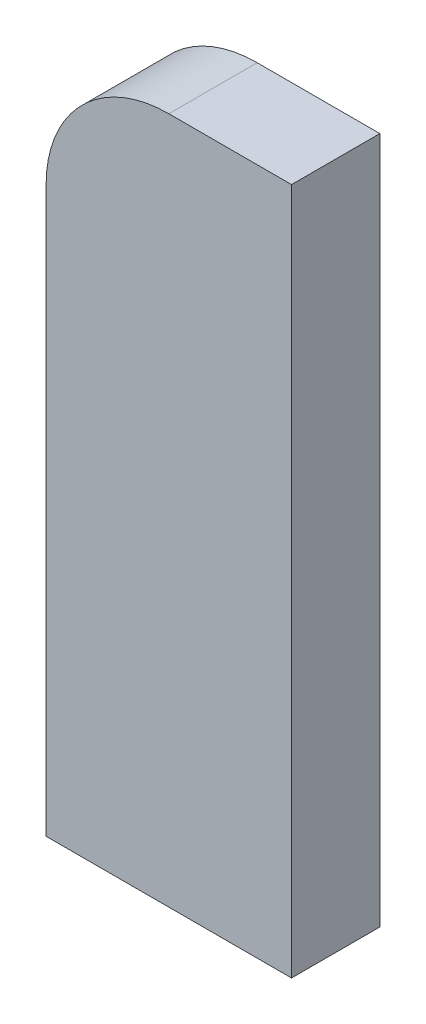
ISO-10303-21;
HEADER;
FILE_DESCRIPTION(('STEP AP214'),'2;1');
FILE_NAME('part.step','',(''),(''),'','','');
FILE_SCHEMA(('AUTOMOTIVE_DESIGN { 1 0 10303 214 1 1 1 1 }'));
ENDSEC;
DATA;
#1=APPLICATION_CONTEXT('core data for automotive mechanical design processes');
#2=APPLICATION_PROTOCOL_DEFINITION('international standard','automotive_design',2000,#1);
#3=PRODUCT_CONTEXT('',#1,'mechanical');
#4=PRODUCT('Part','Part','',(#3));
#5=PRODUCT_RELATED_PRODUCT_CATEGORY('part','',(#4));
#6=PRODUCT_DEFINITION_FORMATION('','',#4);
#7=PRODUCT_DEFINITION_CONTEXT('part definition',#1,'design');
#8=PRODUCT_DEFINITION('design','',#6,#7);
#9=PRODUCT_DEFINITION_SHAPE('','',#8);
#10=(LENGTH_UNIT() NAMED_UNIT(*) SI_UNIT(.MILLI.,.METRE.));
#11=(NAMED_UNIT(*) PLANE_ANGLE_UNIT() SI_UNIT($,.RADIAN.));
#12=(NAMED_UNIT(*) SI_UNIT($,.STERADIAN.) SOLID_ANGLE_UNIT());
#13=UNCERTAINTY_MEASURE_WITH_UNIT(LENGTH_MEASURE(1.E-05),#10,'distance_accuracy_value','');
#14=(GEOMETRIC_REPRESENTATION_CONTEXT(3) GLOBAL_UNCERTAINTY_ASSIGNED_CONTEXT((#13)) GLOBAL_UNIT_ASSIGNED_CONTEXT((#10,
#11,#12)) REPRESENTATION_CONTEXT('',''));
#15=CARTESIAN_POINT('',(0.,0.,0.));
#16=DIRECTION('',(0.,0.,1.));
#17=DIRECTION('',(1.,0.,0.));
#18=AXIS2_PLACEMENT_3D('',#15,#16,#17);
#19=CARTESIAN_POINT('',(0.,0.,9.));
#20=DIRECTION('',(1.,0.,0.));
#21=DIRECTION('',(0.,1.,0.));
#22=AXIS2_PLACEMENT_3D('',#19,#20,#21);
#23=PLANE('',#22);
#24=DIRECTION('',(0.,-1.,0.));
#25=VECTOR('',#24,1.);
#26=CARTESIAN_POINT('',(0.,0.,0.));
#27=LINE('',#26,#25);
#28=CARTESIAN_POINT('',(0.,57.4999999999999,0.));
#29=VERTEX_POINT('',#28);
#30=CARTESIAN_POINT('',(0.,0.,0.));
#31=VERTEX_POINT('',#30);
#32=EDGE_CURVE('E107',#29,#31,#27,.T.);
#33=ORIENTED_EDGE('',*,*,#32,.T.);
#34=DIRECTION('',(0.,0.,-1.));
#35=VECTOR('',#34,1.);
#36=CARTESIAN_POINT('',(0.,0.,9.));
#37=LINE('',#36,#35);
#38=CARTESIAN_POINT('',(0.,0.,9.));
#39=VERTEX_POINT('',#38);
#40=EDGE_CURVE('E11',#39,#31,#37,.T.);
#41=ORIENTED_EDGE('',*,*,#40,.F.);
#42=DIRECTION('',(0.,-1.,0.));
#43=VECTOR('',#42,1.);
#44=CARTESIAN_POINT('',(0.,0.,9.));
#45=LINE('',#44,#43);
#46=CARTESIAN_POINT('',(0.,57.4999999999999,9.));
#47=VERTEX_POINT('',#46);
#48=EDGE_CURVE('E115',#47,#39,#45,.T.);
#49=ORIENTED_EDGE('',*,*,#48,.F.);
#50=DIRECTION('',(0.,0.,-1.));
#51=VECTOR('',#50,1.);
#52=CARTESIAN_POINT('',(0.,57.4999999999999,9.));
#53=LINE('',#52,#51);
#54=EDGE_CURVE('E103',#47,#29,#53,.T.);
#55=ORIENTED_EDGE('',*,*,#54,.T.);
#56=EDGE_LOOP('',(#33,#41,#49,#55));
#57=FACE_BOUND('',#56,.T.);
#58=ADVANCED_FACE('F33',(#57),#23,.F.);
#59=CARTESIAN_POINT('',(0.,0.,9.));
#60=DIRECTION('',(0.,1.,0.));
#61=DIRECTION('',(0.,0.,1.));
#62=AXIS2_PLACEMENT_3D('',#59,#60,#61);
#63=PLANE('',#62);
#64=DIRECTION('',(1.,0.,0.));
#65=VECTOR('',#64,1.);
#66=CARTESIAN_POINT('',(0.,0.,0.));
#67=LINE('',#66,#65);
#68=CARTESIAN_POINT('',(25.,0.,0.));
#69=VERTEX_POINT('',#68);
#70=EDGE_CURVE('E110',#31,#69,#67,.T.);
#71=ORIENTED_EDGE('',*,*,#70,.T.);
#72=DIRECTION('',(0.,0.,-1.));
#73=VECTOR('',#72,1.);
#74=CARTESIAN_POINT('',(25.,0.,9.));
#75=LINE('',#74,#73);
#76=CARTESIAN_POINT('',(25.,0.,9.));
#77=VERTEX_POINT('',#76);
#78=EDGE_CURVE('E41',#77,#69,#75,.T.);
#79=ORIENTED_EDGE('',*,*,#78,.F.);
#80=DIRECTION('',(1.,0.,0.));
#81=VECTOR('',#80,1.);
#82=CARTESIAN_POINT('',(0.,0.,9.));
#83=LINE('',#82,#81);
#84=EDGE_CURVE('E83',#39,#77,#83,.T.);
#85=ORIENTED_EDGE('',*,*,#84,.F.);
#86=ORIENTED_EDGE('',*,*,#40,.T.);
#87=EDGE_LOOP('',(#71,#79,#85,#86));
#88=FACE_BOUND('',#87,.T.);
#89=ADVANCED_FACE('F134',(#88),#63,.F.);
#90=CARTESIAN_POINT('',(25.,0.,9.));
#91=DIRECTION('',(-1.,0.,0.));
#92=DIRECTION('',(0.,-1.,0.));
#93=AXIS2_PLACEMENT_3D('',#90,#91,#92);
#94=PLANE('',#93);
#95=DIRECTION('',(0.,1.,0.));
#96=VECTOR('',#95,1.);
#97=CARTESIAN_POINT('',(25.,0.,0.));
#98=LINE('',#97,#96);
#99=CARTESIAN_POINT('',(25.,70.,0.));
#100=VERTEX_POINT('',#99);
#101=EDGE_CURVE('E98',#69,#100,#98,.T.);
#102=ORIENTED_EDGE('',*,*,#101,.T.);
#103=DIRECTION('',(0.,0.,-1.));
#104=VECTOR('',#103,1.);
#105=CARTESIAN_POINT('',(25.,70.,9.));
#106=LINE('',#105,#104);
#107=CARTESIAN_POINT('',(25.,70.,9.));
#108=VERTEX_POINT('',#107);
#109=EDGE_CURVE('E95',#108,#100,#106,.T.);
#110=ORIENTED_EDGE('',*,*,#109,.F.);
#111=DIRECTION('',(0.,1.,0.));
#112=VECTOR('',#111,1.);
#113=CARTESIAN_POINT('',(25.,0.,9.));
#114=LINE('',#113,#112);
#115=EDGE_CURVE('E87',#77,#108,#114,.T.);
#116=ORIENTED_EDGE('',*,*,#115,.F.);
#117=ORIENTED_EDGE('',*,*,#78,.T.);
#118=EDGE_LOOP('',(#102,#110,#116,#117));
#119=FACE_BOUND('',#118,.T.);
#120=ADVANCED_FACE('F96',(#119),#94,.F.);
#121=CARTESIAN_POINT('',(12.5000000000001,70.,9.));
#122=DIRECTION('',(0.,-1.,0.));
#123=DIRECTION('',(0.,0.,-1.));
#124=AXIS2_PLACEMENT_3D('',#121,#122,#123);
#125=PLANE('',#124);
#126=DIRECTION('',(-1.,0.,0.));
#127=VECTOR('',#126,1.);
#128=CARTESIAN_POINT('',(12.5000000000001,70.,0.));
#129=LINE('',#128,#127);
#130=CARTESIAN_POINT('',(12.5000000000001,70.,0.));
#131=VERTEX_POINT('',#130);
#132=EDGE_CURVE('E69',#100,#131,#129,.T.);
#133=ORIENTED_EDGE('',*,*,#132,.T.);
#134=DIRECTION('',(0.,0.,-1.));
#135=VECTOR('',#134,1.);
#136=CARTESIAN_POINT('',(12.5000000000001,70.,9.));
#137=LINE('',#136,#135);
#138=CARTESIAN_POINT('',(12.5000000000001,70.,9.));
#139=VERTEX_POINT('',#138);
#140=EDGE_CURVE('E99',#139,#131,#137,.T.);
#141=ORIENTED_EDGE('',*,*,#140,.F.);
#142=DIRECTION('',(-1.,0.,0.));
#143=VECTOR('',#142,1.);
#144=CARTESIAN_POINT('',(12.5000000000001,70.,9.));
#145=LINE('',#144,#143);
#146=EDGE_CURVE('E91',#108,#139,#145,.T.);
#147=ORIENTED_EDGE('',*,*,#146,.F.);
#148=ORIENTED_EDGE('',*,*,#109,.T.);
#149=EDGE_LOOP('',(#133,#141,#147,#148));
#150=FACE_BOUND('',#149,.T.);
#151=ADVANCED_FACE('F101',(#150),#125,.F.);
#152=CARTESIAN_POINT('',(12.5,57.5,9.));
#153=DIRECTION('',(0.,0.,-1.));
#154=DIRECTION('',(-1.,0.,0.));
#155=AXIS2_PLACEMENT_3D('',#152,#153,#154);
#156=CYLINDRICAL_SURFACE('',#155,12.5);
#157=CARTESIAN_POINT('',(12.5,57.5,0.));
#158=DIRECTION('',(0.,0.,1.));
#159=DIRECTION('',(1.,0.,0.));
#160=AXIS2_PLACEMENT_3D('',#157,#158,#159);
#161=CIRCLE('',#160,12.5);
#162=EDGE_CURVE('E75',#131,#29,#161,.T.);
#163=ORIENTED_EDGE('',*,*,#162,.T.);
#164=ORIENTED_EDGE('',*,*,#54,.F.);
#165=CARTESIAN_POINT('',(12.5,57.5,9.));
#166=DIRECTION('',(0.,0.,1.));
#167=DIRECTION('',(1.,0.,0.));
#168=AXIS2_PLACEMENT_3D('',#165,#166,#167);
#169=CIRCLE('',#168,12.5);
#170=EDGE_CURVE('E49',#139,#47,#169,.T.);
#171=ORIENTED_EDGE('',*,*,#170,.F.);
#172=ORIENTED_EDGE('',*,*,#140,.T.);
#173=EDGE_LOOP('',(#163,#164,#171,#172));
#174=FACE_BOUND('',#173,.T.);
#175=ADVANCED_FACE('F123',(#174),#156,.T.);
#176=CARTESIAN_POINT('',(12.5,57.5,9.));
#177=DIRECTION('',(0.,0.,1.));
#178=DIRECTION('',(1.,0.,0.));
#179=AXIS2_PLACEMENT_3D('',#176,#177,#178);
#180=PLANE('',#179);
#181=ORIENTED_EDGE('',*,*,#48,.T.);
#182=ORIENTED_EDGE('',*,*,#84,.T.);
#183=ORIENTED_EDGE('',*,*,#115,.T.);
#184=ORIENTED_EDGE('',*,*,#146,.T.);
#185=ORIENTED_EDGE('',*,*,#170,.T.);
#186=EDGE_LOOP('',(#181,#182,#183,#184,#185));
#187=FACE_BOUND('',#186,.T.);
#188=ADVANCED_FACE('F89',(#187),#180,.T.);
#189=CARTESIAN_POINT('',(12.5,57.5,0.));
#190=DIRECTION('',(0.,0.,1.));
#191=DIRECTION('',(1.,0.,0.));
#192=AXIS2_PLACEMENT_3D('',#189,#190,#191);
#193=PLANE('',#192);
#194=ORIENTED_EDGE('',*,*,#32,.F.);
#195=ORIENTED_EDGE('',*,*,#162,.F.);
#196=ORIENTED_EDGE('',*,*,#132,.F.);
#197=ORIENTED_EDGE('',*,*,#101,.F.);
#198=ORIENTED_EDGE('',*,*,#70,.F.);
#199=EDGE_LOOP('',(#194,#195,#196,#197,#198));
#200=FACE_BOUND('',#199,.T.);
#201=ADVANCED_FACE('F119',(#200),#193,.F.);
#202=CLOSED_SHELL('',(#58,#89,#120,#151,#175,#188,#201));
#203=MANIFOLD_SOLID_BREP('B2',#202);
#204=ADVANCED_BREP_SHAPE_REPRESENTATION('',(#18,#203),#14);
#205=SHAPE_DEFINITION_REPRESENTATION(#9,#204);
ENDSEC;
END-ISO-10303-21;
